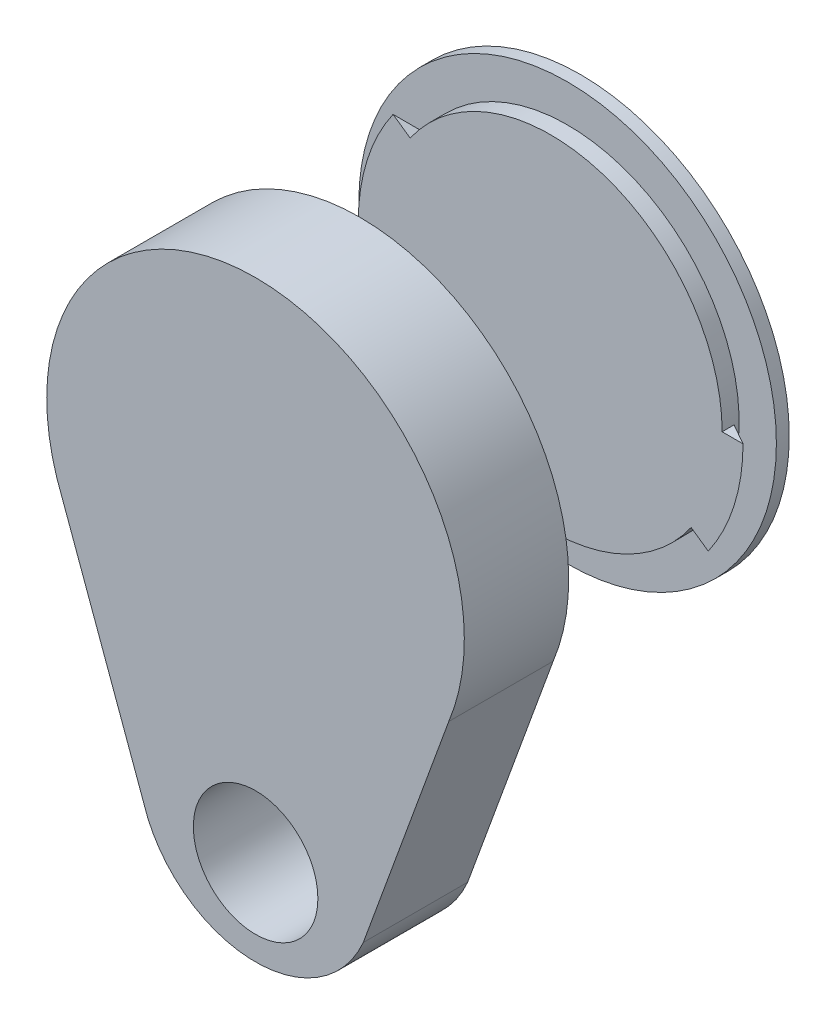
ISO-10303-21;
HEADER;
FILE_DESCRIPTION(('STEP AP214'),'2;1');
FILE_NAME('part.step','',(''),(''),'','','');
FILE_SCHEMA(('AUTOMOTIVE_DESIGN { 1 0 10303 214 1 1 1 1 }'));
ENDSEC;
DATA;
#1=APPLICATION_CONTEXT('core data for automotive mechanical design processes');
#2=APPLICATION_PROTOCOL_DEFINITION('international standard','automotive_design',2000,#1);
#3=PRODUCT_CONTEXT('',#1,'mechanical');
#4=PRODUCT('Part','Part','',(#3));
#5=PRODUCT_RELATED_PRODUCT_CATEGORY('part','',(#4));
#6=PRODUCT_DEFINITION_FORMATION('','',#4);
#7=PRODUCT_DEFINITION_CONTEXT('part definition',#1,'design');
#8=PRODUCT_DEFINITION('design','',#6,#7);
#9=PRODUCT_DEFINITION_SHAPE('','',#8);
#10=(LENGTH_UNIT() NAMED_UNIT(*) SI_UNIT(.MILLI.,.METRE.));
#11=(NAMED_UNIT(*) PLANE_ANGLE_UNIT() SI_UNIT($,.RADIAN.));
#12=(NAMED_UNIT(*) SI_UNIT($,.STERADIAN.) SOLID_ANGLE_UNIT());
#13=UNCERTAINTY_MEASURE_WITH_UNIT(LENGTH_MEASURE(1.E-05),#10,'distance_accuracy_value','');
#14=(GEOMETRIC_REPRESENTATION_CONTEXT(3) GLOBAL_UNCERTAINTY_ASSIGNED_CONTEXT((#13)) GLOBAL_UNIT_ASSIGNED_CONTEXT((#10,
#11,#12)) REPRESENTATION_CONTEXT('',''));
#15=CARTESIAN_POINT('',(0.,0.,0.));
#16=DIRECTION('',(0.,0.,1.));
#17=DIRECTION('',(1.,0.,0.));
#18=AXIS2_PLACEMENT_3D('',#15,#16,#17);
#19=CARTESIAN_POINT('',(0.663591955990757,0.,-19.6420365367826));
#20=DIRECTION('',(0.,0.,-1.));
#21=DIRECTION('',(-1.,0.,0.));
#22=AXIS2_PLACEMENT_3D('',#19,#20,#21);
#23=CYLINDRICAL_SURFACE('',#22,11.5);
#24=CARTESIAN_POINT('',(0.663591955990757,0.,-18.779037110636));
#25=DIRECTION('',(0.,0.,-1.));
#26=DIRECTION('',(-1.,0.,0.));
#27=AXIS2_PLACEMENT_3D('',#24,#25,#26);
#28=CIRCLE('',#27,11.5);
#29=CARTESIAN_POINT('',(-10.8364080440092,0.,-18.779037110636));
#30=VERTEX_POINT('',#29);
#31=EDGE_CURVE('E151',#30,#30,#28,.T.);
#32=ORIENTED_EDGE('',*,*,#31,.F.);
#33=EDGE_LOOP('',(#32));
#34=FACE_BOUND('',#33,.T.);
#35=CARTESIAN_POINT('',(0.663591955990757,0.,-18.4420365367826));
#36=DIRECTION('',(0.,0.,1.));
#37=DIRECTION('',(-1.,0.,0.));
#38=AXIS2_PLACEMENT_3D('',#35,#36,#37);
#39=CIRCLE('',#38,11.5);
#40=CARTESIAN_POINT('',(10.0838404653142,-6.59612901803705,-18.4420365367826));
#41=VERTEX_POINT('',#40);
#42=CARTESIAN_POINT('',(12.1635919559908,0.,-18.4420365367826));
#43=VERTEX_POINT('',#42);
#44=EDGE_CURVE('E62',#41,#43,#39,.T.);
#45=ORIENTED_EDGE('',*,*,#44,.F.);
#46=DIRECTION('',(0.,0.,-1.));
#47=VECTOR('',#46,1.);
#48=CARTESIAN_POINT('',(10.0838404653142,-6.59612901803704,-18.4420365367826));
#49=LINE('',#48,#47);
#50=CARTESIAN_POINT('',(10.0838404653142,-6.59612901803704,-17.6420365367826));
#51=VERTEX_POINT('',#50);
#52=EDGE_CURVE('E115',#51,#41,#49,.T.);
#53=ORIENTED_EDGE('',*,*,#52,.F.);
#54=CARTESIAN_POINT('',(0.663591955990757,0.,-17.6420365367826));
#55=DIRECTION('',(0.,0.,-1.));
#56=DIRECTION('',(-1.,0.,0.));
#57=AXIS2_PLACEMENT_3D('',#54,#55,#56);
#58=CIRCLE('',#57,11.5);
#59=CARTESIAN_POINT('',(-10.8364080440092,0.,-17.6420365367826));
#60=VERTEX_POINT('',#59);
#61=EDGE_CURVE('E55',#51,#60,#58,.T.);
#62=ORIENTED_EDGE('',*,*,#61,.T.);
#63=DIRECTION('',(0.,0.,-1.));
#64=VECTOR('',#63,1.);
#65=CARTESIAN_POINT('',(-10.8364080440092,0.,-18.4420365367826));
#66=LINE('',#65,#64);
#67=CARTESIAN_POINT('',(-10.8364080440092,0.,-18.4420365367826));
#68=VERTEX_POINT('',#67);
#69=EDGE_CURVE('E107',#60,#68,#66,.T.);
#70=ORIENTED_EDGE('',*,*,#69,.T.);
#71=CARTESIAN_POINT('',(0.663591955990757,0.,-18.4420365367826));
#72=DIRECTION('',(0.,0.,1.));
#73=DIRECTION('',(1.,0.,0.));
#74=AXIS2_PLACEMENT_3D('',#71,#72,#73);
#75=CIRCLE('',#74,11.5);
#76=CARTESIAN_POINT('',(-8.75665655333264,6.59612901803704,-18.4420365367826));
#77=VERTEX_POINT('',#76);
#78=EDGE_CURVE('E141',#77,#68,#75,.T.);
#79=ORIENTED_EDGE('',*,*,#78,.F.);
#80=DIRECTION('',(0.,0.,-1.));
#81=VECTOR('',#80,1.);
#82=CARTESIAN_POINT('',(-8.75665655333264,6.59612901803704,-18.4420365367826));
#83=LINE('',#82,#81);
#84=CARTESIAN_POINT('',(-8.75665655333264,6.59612901803704,-17.6420365367826));
#85=VERTEX_POINT('',#84);
#86=EDGE_CURVE('E132',#85,#77,#83,.T.);
#87=ORIENTED_EDGE('',*,*,#86,.F.);
#88=CARTESIAN_POINT('',(12.1635919559908,0.,-17.6420365367826));
#89=VERTEX_POINT('',#88);
#90=EDGE_CURVE('E12',#85,#89,#58,.T.);
#91=ORIENTED_EDGE('',*,*,#90,.T.);
#92=DIRECTION('',(0.,0.,-1.));
#93=VECTOR('',#92,1.);
#94=CARTESIAN_POINT('',(12.1635919559908,0.,-18.4420365367826));
#95=LINE('',#94,#93);
#96=EDGE_CURVE('E66',#89,#43,#95,.T.);
#97=ORIENTED_EDGE('',*,*,#96,.T.);
#98=EDGE_LOOP('',(#45,#53,#62,#70,#79,#87,#91,#97));
#99=FACE_BOUND('',#98,.T.);
#100=ADVANCED_FACE('F47',(#34,#99),#23,.T.);
#101=CARTESIAN_POINT('',(0.663591955990757,0.,-17.6420365367826));
#102=DIRECTION('',(0.,0.,1.));
#103=DIRECTION('',(1.,0.,0.));
#104=AXIS2_PLACEMENT_3D('',#101,#102,#103);
#105=PLANE('',#104);
#106=ORIENTED_EDGE('',*,*,#90,.F.);
#107=DIRECTION('',(0.819152044288991,-0.573576436351047,0.));
#108=VECTOR('',#107,1.);
#109=CARTESIAN_POINT('',(-8.75665655333264,6.59612901803704,-17.6420365367826));
#110=LINE('',#109,#108);
#111=CARTESIAN_POINT('',(-9.90346941533723,7.39913602892851,-17.6420365367826));
#112=VERTEX_POINT('',#111);
#113=EDGE_CURVE('E138',#112,#85,#110,.T.);
#114=ORIENTED_EDGE('',*,*,#113,.F.);
#115=CARTESIAN_POINT('',(0.663591955990757,0.,-17.6420365367826));
#116=DIRECTION('',(0.,0.,1.));
#117=DIRECTION('',(1.,0.,0.));
#118=AXIS2_PLACEMENT_3D('',#115,#116,#117);
#119=CIRCLE('',#118,12.9);
#120=CARTESIAN_POINT('',(-12.2364080440092,0.,-17.6420365367826));
#121=VERTEX_POINT('',#120);
#122=EDGE_CURVE('E144',#112,#121,#119,.T.);
#123=ORIENTED_EDGE('',*,*,#122,.T.);
#124=DIRECTION('',(1.,0.,0.));
#125=VECTOR('',#124,1.);
#126=CARTESIAN_POINT('',(-10.8364080440092,0.,-17.6420365367826));
#127=LINE('',#126,#125);
#128=EDGE_CURVE('E129',#121,#60,#127,.T.);
#129=ORIENTED_EDGE('',*,*,#128,.T.);
#130=ORIENTED_EDGE('',*,*,#61,.F.);
#131=DIRECTION('',(-0.819152044288991,0.573576436351047,0.));
#132=VECTOR('',#131,1.);
#133=CARTESIAN_POINT('',(10.0838404653142,-6.59612901803704,-17.6420365367826));
#134=LINE('',#133,#132);
#135=CARTESIAN_POINT('',(11.2306533273187,-7.39913602892851,-17.6420365367826));
#136=VERTEX_POINT('',#135);
#137=EDGE_CURVE('E104',#136,#51,#134,.T.);
#138=ORIENTED_EDGE('',*,*,#137,.F.);
#139=CARTESIAN_POINT('',(0.663591955990757,0.,-17.6420365367826));
#140=DIRECTION('',(0.,0.,1.));
#141=DIRECTION('',(-1.,0.,0.));
#142=AXIS2_PLACEMENT_3D('',#139,#140,#141);
#143=CIRCLE('',#142,12.9);
#144=CARTESIAN_POINT('',(13.5635919559908,0.,-17.6420365367826));
#145=VERTEX_POINT('',#144);
#146=EDGE_CURVE('E98',#136,#145,#143,.T.);
#147=ORIENTED_EDGE('',*,*,#146,.T.);
#148=DIRECTION('',(-1.,0.,0.));
#149=VECTOR('',#148,1.);
#150=CARTESIAN_POINT('',(12.1635919559908,0.,-17.6420365367826));
#151=LINE('',#150,#149);
#152=EDGE_CURVE('E102',#145,#89,#151,.T.);
#153=ORIENTED_EDGE('',*,*,#152,.T.);
#154=EDGE_LOOP('',(#106,#114,#123,#129,#130,#138,#147,#153));
#155=FACE_BOUND('',#154,.T.);
#156=ADVANCED_FACE('F49',(#155),#105,.T.);
#157=CARTESIAN_POINT('',(-10.8364080440092,0.,-18.779037110636));
#158=DIRECTION('',(0.,0.,1.));
#159=DIRECTION('',(1.,0.,0.));
#160=AXIS2_PLACEMENT_3D('',#157,#158,#159);
#161=PLANE('',#160);
#162=ORIENTED_EDGE('',*,*,#31,.T.);
#163=EDGE_LOOP('',(#162));
#164=FACE_BOUND('',#163,.T.);
#165=CARTESIAN_POINT('',(0.663591955990757,0.,-18.779037110636));
#166=DIRECTION('',(0.,0.,-1.));
#167=DIRECTION('',(-1.,0.,0.));
#168=AXIS2_PLACEMENT_3D('',#165,#166,#167);
#169=CIRCLE('',#168,14.);
#170=CARTESIAN_POINT('',(-13.3364080440092,0.,-18.779037110636));
#171=VERTEX_POINT('',#170);
#172=EDGE_CURVE('E149',#171,#171,#169,.T.);
#173=ORIENTED_EDGE('',*,*,#172,.F.);
#174=EDGE_LOOP('',(#173));
#175=FACE_BOUND('',#174,.T.);
#176=ADVANCED_FACE('F180',(#164,#175),#161,.T.);
#177=CARTESIAN_POINT('',(0.663591955990757,0.,-19.6420365367826));
#178=DIRECTION('',(0.,0.,-1.));
#179=DIRECTION('',(-1.,0.,0.));
#180=AXIS2_PLACEMENT_3D('',#177,#178,#179);
#181=CYLINDRICAL_SURFACE('',#180,14.);
#182=ORIENTED_EDGE('',*,*,#172,.T.);
#183=EDGE_LOOP('',(#182));
#184=FACE_BOUND('',#183,.T.);
#185=CARTESIAN_POINT('',(0.663591955990757,0.,-19.6420365367826));
#186=DIRECTION('',(0.,0.,-1.));
#187=DIRECTION('',(-1.,0.,0.));
#188=AXIS2_PLACEMENT_3D('',#185,#186,#187);
#189=CIRCLE('',#188,14.);
#190=CARTESIAN_POINT('',(-13.3364080440092,0.,-19.6420365367826));
#191=VERTEX_POINT('',#190);
#192=EDGE_CURVE('E146',#191,#191,#189,.T.);
#193=ORIENTED_EDGE('',*,*,#192,.F.);
#194=EDGE_LOOP('',(#193));
#195=FACE_BOUND('',#194,.T.);
#196=ADVANCED_FACE('F184',(#184,#195),#181,.T.);
#197=CARTESIAN_POINT('',(-13.3364080440092,0.,-19.6420365367826));
#198=DIRECTION('',(0.,0.,-1.));
#199=DIRECTION('',(-1.,0.,0.));
#200=AXIS2_PLACEMENT_3D('',#197,#198,#199);
#201=PLANE('',#200);
#202=ORIENTED_EDGE('',*,*,#192,.T.);
#203=EDGE_LOOP('',(#202));
#204=FACE_BOUND('',#203,.T.);
#205=ADVANCED_FACE('F173',(#204),#201,.T.);
#206=CARTESIAN_POINT('',(0.663591955990757,0.,-18.4420365367826));
#207=DIRECTION('',(0.,0.,1.));
#208=DIRECTION('',(1.,0.,0.));
#209=AXIS2_PLACEMENT_3D('',#206,#207,#208);
#210=CONICAL_SURFACE('',#209,11.5,1.05165021254837);
#211=DIRECTION('',(-0.711223144811148,0.498003807345983,0.496138938356833));
#212=VECTOR('',#211,1.);
#213=CARTESIAN_POINT('',(-9.90346941533723,7.39913602892851,-17.6420365367826));
#214=LINE('',#213,#212);
#215=EDGE_CURVE('E135',#77,#112,#214,.T.);
#216=ORIENTED_EDGE('',*,*,#215,.F.);
#217=ORIENTED_EDGE('',*,*,#78,.T.);
#218=DIRECTION('',(-0.86824314212446,0.,0.496138938356833));
#219=VECTOR('',#218,1.);
#220=CARTESIAN_POINT('',(-12.2364080440092,0.,-17.6420365367826));
#221=LINE('',#220,#219);
#222=EDGE_CURVE('E126',#68,#121,#221,.T.);
#223=ORIENTED_EDGE('',*,*,#222,.T.);
#224=ORIENTED_EDGE('',*,*,#122,.F.);
#225=EDGE_LOOP('',(#216,#217,#223,#224));
#226=FACE_BOUND('',#225,.T.);
#227=ADVANCED_FACE('F163',(#226),#210,.T.);
#228=CARTESIAN_POINT('',(0.120009248667199,0.3806207093084,0.));
#229=DIRECTION('',(-0.573576436351047,-0.819152044288991,0.));
#230=DIRECTION('',(0.,0.,-1.));
#231=AXIS2_PLACEMENT_3D('',#228,#229,#230);
#232=PLANE('',#231);
#233=ORIENTED_EDGE('',*,*,#86,.T.);
#234=ORIENTED_EDGE('',*,*,#215,.T.);
#235=ORIENTED_EDGE('',*,*,#113,.T.);
#236=EDGE_LOOP('',(#233,#234,#235));
#237=FACE_BOUND('',#236,.T.);
#238=ADVANCED_FACE('F165',(#237),#232,.F.);
#239=CARTESIAN_POINT('',(0.,0.,0.));
#240=DIRECTION('',(0.,-1.,0.));
#241=DIRECTION('',(0.,0.,-1.));
#242=AXIS2_PLACEMENT_3D('',#239,#240,#241);
#243=PLANE('',#242);
#244=ORIENTED_EDGE('',*,*,#69,.F.);
#245=ORIENTED_EDGE('',*,*,#128,.F.);
#246=ORIENTED_EDGE('',*,*,#222,.F.);
#247=EDGE_LOOP('',(#244,#245,#246));
#248=FACE_BOUND('',#247,.T.);
#249=ADVANCED_FACE('F160',(#248),#243,.T.);
#250=CARTESIAN_POINT('',(0.663591955990757,0.,-18.4420365367826));
#251=DIRECTION('',(0.,0.,1.));
#252=DIRECTION('',(-1.,0.,0.));
#253=AXIS2_PLACEMENT_3D('',#250,#251,#252);
#254=CONICAL_SURFACE('',#253,11.5,1.05165021254837);
#255=DIRECTION('',(0.711223144811148,-0.498003807345983,0.496138938356833));
#256=VECTOR('',#255,1.);
#257=CARTESIAN_POINT('',(11.2306533273187,-7.39913602892851,-17.6420365367826));
#258=LINE('',#257,#256);
#259=EDGE_CURVE('E118',#41,#136,#258,.T.);
#260=ORIENTED_EDGE('',*,*,#259,.F.);
#261=ORIENTED_EDGE('',*,*,#44,.T.);
#262=DIRECTION('',(0.86824314212446,0.,0.496138938356833));
#263=VECTOR('',#262,1.);
#264=CARTESIAN_POINT('',(13.5635919559908,0.,-17.6420365367826));
#265=LINE('',#264,#263);
#266=EDGE_CURVE('E110',#43,#145,#265,.T.);
#267=ORIENTED_EDGE('',*,*,#266,.T.);
#268=ORIENTED_EDGE('',*,*,#146,.F.);
#269=EDGE_LOOP('',(#260,#261,#267,#268));
#270=FACE_BOUND('',#269,.T.);
#271=ADVANCED_FACE('F111',(#270),#254,.T.);
#272=CARTESIAN_POINT('',(1.20717466331432,-0.3806207093084,0.));
#273=DIRECTION('',(0.573576436351047,0.819152044288991,0.));
#274=DIRECTION('',(0.,0.,-1.));
#275=AXIS2_PLACEMENT_3D('',#272,#273,#274);
#276=PLANE('',#275);
#277=ORIENTED_EDGE('',*,*,#52,.T.);
#278=ORIENTED_EDGE('',*,*,#259,.T.);
#279=ORIENTED_EDGE('',*,*,#137,.T.);
#280=EDGE_LOOP('',(#277,#278,#279));
#281=FACE_BOUND('',#280,.T.);
#282=ADVANCED_FACE('F231',(#281),#276,.F.);
#283=CARTESIAN_POINT('',(1.32718391198152,0.,0.));
#284=DIRECTION('',(0.,1.,0.));
#285=DIRECTION('',(0.,0.,-1.));
#286=AXIS2_PLACEMENT_3D('',#283,#284,#285);
#287=PLANE('',#286);
#288=ORIENTED_EDGE('',*,*,#96,.F.);
#289=ORIENTED_EDGE('',*,*,#152,.F.);
#290=ORIENTED_EDGE('',*,*,#266,.F.);
#291=EDGE_LOOP('',(#288,#289,#290));
#292=FACE_BOUND('',#291,.T.);
#293=ADVANCED_FACE('F114',(#292),#287,.T.);
#294=CLOSED_SHELL('',(#100,#156,#176,#196,#205,#227,#238,#249,#271,#282,#293));
#295=MANIFOLD_SOLID_BREP('B2',#294);
#296=CARTESIAN_POINT('',(1.56253248721312,0.,2.04604094610826));
#297=DIRECTION('',(0.,0.,-1.));
#298=DIRECTION('',(-1.,0.,0.));
#299=AXIS2_PLACEMENT_3D('',#296,#297,#298);
#300=CYLINDRICAL_SURFACE('',#299,13.);
#301=CARTESIAN_POINT('',(1.56253248721312,0.,2.04604094610826));
#302=DIRECTION('',(0.,0.,-1.));
#303=DIRECTION('',(-1.,0.,0.));
#304=AXIS2_PLACEMENT_3D('',#301,#302,#303);
#305=CIRCLE('',#304,13.);
#306=CARTESIAN_POINT('',(-11.4374675127869,0.,2.04604094610826));
#307=VERTEX_POINT('',#306);
#308=EDGE_CURVE('E433',#307,#307,#305,.T.);
#309=ORIENTED_EDGE('',*,*,#308,.F.);
#310=EDGE_LOOP('',(#309));
#311=FACE_BOUND('',#310,.T.);
#312=CARTESIAN_POINT('',(1.56253248721312,0.,-3.15395905389174));
#313=DIRECTION('',(0.,0.,1.));
#314=DIRECTION('',(-1.,0.,0.));
#315=AXIS2_PLACEMENT_3D('',#312,#313,#314);
#316=CIRCLE('',#315,13.);
#317=CARTESIAN_POINT('',(-8.39604527333364,-8.35623892592496,-3.15395905389174));
#318=VERTEX_POINT('',#317);
#319=CARTESIAN_POINT('',(14.5625324872131,0.,-3.15395905389174));
#320=VERTEX_POINT('',#319);
#321=EDGE_CURVE('E291',#318,#320,#316,.T.);
#322=ORIENTED_EDGE('',*,*,#321,.F.);
#323=DIRECTION('',(0.,0.,1.));
#324=VECTOR('',#323,1.);
#325=CARTESIAN_POINT('',(-8.39604527333364,-8.35623892592496,-3.15395905389174));
#326=LINE('',#325,#324);
#327=CARTESIAN_POINT('',(-8.39604527333364,-8.35623892592496,-3.95395905389174));
#328=VERTEX_POINT('',#327);
#329=EDGE_CURVE('E369',#328,#318,#326,.T.);
#330=ORIENTED_EDGE('',*,*,#329,.F.);
#331=CARTESIAN_POINT('',(1.56253248721312,0.,-3.95395905389174));
#332=DIRECTION('',(0.,0.,-1.));
#333=DIRECTION('',(-1.,0.,0.));
#334=AXIS2_PLACEMENT_3D('',#331,#332,#333);
#335=CIRCLE('',#334,13.);
#336=CARTESIAN_POINT('',(-11.4374675127869,0.,-3.95395905389174));
#337=VERTEX_POINT('',#336);
#338=EDGE_CURVE('E436',#328,#337,#335,.T.);
#339=ORIENTED_EDGE('',*,*,#338,.T.);
#340=DIRECTION('',(0.,0.,1.));
#341=VECTOR('',#340,1.);
#342=CARTESIAN_POINT('',(-11.4374675127869,0.,-3.15395905389174));
#343=LINE('',#342,#341);
#344=CARTESIAN_POINT('',(-11.4374675127869,0.,-3.15395905389174));
#345=VERTEX_POINT('',#344);
#346=EDGE_CURVE('E361',#337,#345,#343,.T.);
#347=ORIENTED_EDGE('',*,*,#346,.T.);
#348=CARTESIAN_POINT('',(1.56253248721312,0.,-3.15395905389174));
#349=DIRECTION('',(0.,0.,1.));
#350=DIRECTION('',(1.,0.,0.));
#351=AXIS2_PLACEMENT_3D('',#348,#349,#350);
#352=CIRCLE('',#351,13.);
#353=CARTESIAN_POINT('',(11.5211102477599,8.35623892592496,-3.15395905389174));
#354=VERTEX_POINT('',#353);
#355=EDGE_CURVE('E395',#354,#345,#352,.T.);
#356=ORIENTED_EDGE('',*,*,#355,.F.);
#357=DIRECTION('',(0.,0.,1.));
#358=VECTOR('',#357,1.);
#359=CARTESIAN_POINT('',(11.5211102477599,8.35623892592496,-3.15395905389174));
#360=LINE('',#359,#358);
#361=CARTESIAN_POINT('',(11.5211102477599,8.35623892592495,-3.95395905389174));
#362=VERTEX_POINT('',#361);
#363=EDGE_CURVE('E386',#362,#354,#360,.T.);
#364=ORIENTED_EDGE('',*,*,#363,.F.);
#365=CARTESIAN_POINT('',(14.5625324872131,0.,-3.95395905389174));
#366=VERTEX_POINT('',#365);
#367=EDGE_CURVE('E437',#362,#366,#335,.T.);
#368=ORIENTED_EDGE('',*,*,#367,.T.);
#369=DIRECTION('',(0.,0.,1.));
#370=VECTOR('',#369,1.);
#371=CARTESIAN_POINT('',(14.5625324872131,0.,-3.15395905389174));
#372=LINE('',#371,#370);
#373=EDGE_CURVE('E296',#366,#320,#372,.T.);
#374=ORIENTED_EDGE('',*,*,#373,.T.);
#375=EDGE_LOOP('',(#322,#330,#339,#347,#356,#364,#368,#374));
#376=FACE_BOUND('',#375,.T.);
#377=ADVANCED_FACE('F276',(#311,#376),#300,.F.);
#378=CARTESIAN_POINT('',(1.56253248721312,0.,3.04604094610826));
#379=DIRECTION('',(0.,0.,1.));
#380=DIRECTION('',(1.,0.,0.));
#381=AXIS2_PLACEMENT_3D('',#378,#379,#380);
#382=PLANE('',#381);
#383=CARTESIAN_POINT('',(1.56883584325146,-19.9707842026667,3.04604094610826));
#384=DIRECTION('',(0.,0.,1.));
#385=DIRECTION('',(1.,0.,0.));
#386=AXIS2_PLACEMENT_3D('',#383,#384,#385);
#387=CIRCLE('',#386,4.17530587226947);
#388=CARTESIAN_POINT('',(5.74414171552093,-19.9707842026667,3.04604094610826));
#389=VERTEX_POINT('',#388);
#390=EDGE_CURVE('E400',#389,#389,#387,.T.);
#391=ORIENTED_EDGE('',*,*,#390,.F.);
#392=EDGE_LOOP('',(#391));
#393=FACE_BOUND('',#392,.T.);
#394=CARTESIAN_POINT('',(1.56253248721312,0.,3.04604094610826));
#395=DIRECTION('',(0.,0.,-1.));
#396=DIRECTION('',(-1.,0.,0.));
#397=AXIS2_PLACEMENT_3D('',#394,#395,#396);
#398=CIRCLE('',#397,14.);
#399=CARTESIAN_POINT('',(-11.3937503946181,-5.30421849907854,3.04604094610826));
#400=VERTEX_POINT('',#399);
#401=CARTESIAN_POINT('',(14.5188153690457,-5.30421849907517,3.04604094610826));
#402=VERTEX_POINT('',#401);
#403=EDGE_CURVE('E45',#400,#402,#398,.T.);
#404=ORIENTED_EDGE('',*,*,#403,.F.);
#405=DIRECTION('',(0.342928016815301,-0.93936168501974,0.));
#406=VECTOR('',#405,1.);
#407=CARTESIAN_POINT('',(-5.66377086882536,-21.,3.04604094610826));
#408=LINE('',#407,#406);
#409=CARTESIAN_POINT('',(-5.66377086882536,-21.,3.04604094610826));
#410=VERTEX_POINT('',#409);
#411=EDGE_CURVE('E404',#400,#410,#408,.T.);
#412=ORIENTED_EDGE('',*,*,#411,.T.);
#413=CARTESIAN_POINT('',(1.56253248721305,-17.8753087844882,3.04604094610826));
#414=DIRECTION('',(0.,0.,1.));
#415=DIRECTION('',(-1.,0.,0.));
#416=AXIS2_PLACEMENT_3D('',#413,#414,#415);
#417=CIRCLE('',#416,7.87293816727836);
#418=CARTESIAN_POINT('',(8.78883584325146,-21.,3.04604094610826));
#419=VERTEX_POINT('',#418);
#420=EDGE_CURVE('E418',#410,#419,#417,.T.);
#421=ORIENTED_EDGE('',*,*,#420,.T.);
#422=DIRECTION('',(0.342928016815316,0.939361685019734,0.));
#423=VECTOR('',#422,1.);
#424=CARTESIAN_POINT('',(14.8888396600129,-4.29063365205939,3.04604094610826));
#425=LINE('',#424,#423);
#426=EDGE_CURVE('E410',#419,#402,#425,.T.);
#427=ORIENTED_EDGE('',*,*,#426,.T.);
#428=EDGE_LOOP('',(#404,#412,#421,#427));
#429=FACE_BOUND('',#428,.T.);
#430=ADVANCED_FACE('F278',(#393,#429),#382,.T.);
#431=CARTESIAN_POINT('',(1.56253248721312,0.,2.04604094610826));
#432=DIRECTION('',(0.,0.,-1.));
#433=DIRECTION('',(-1.,0.,0.));
#434=AXIS2_PLACEMENT_3D('',#431,#432,#433);
#435=CYLINDRICAL_SURFACE('',#434,14.);
#436=DIRECTION('',(0.,0.,-1.));
#437=VECTOR('',#436,1.);
#438=CARTESIAN_POINT('',(-11.3937503946181,-5.30421849907855,2.04604094610826));
#439=LINE('',#438,#437);
#440=CARTESIAN_POINT('',(-11.3937503946181,-5.30421849907855,-3.95395905389174));
#441=VERTEX_POINT('',#440);
#442=EDGE_CURVE('E425',#400,#441,#439,.T.);
#443=ORIENTED_EDGE('',*,*,#442,.F.);
#444=ORIENTED_EDGE('',*,*,#403,.T.);
#445=DIRECTION('',(0.,0.,-1.));
#446=VECTOR('',#445,1.);
#447=CARTESIAN_POINT('',(14.5188153690457,-5.30421849907514,2.04604094610826));
#448=LINE('',#447,#446);
#449=CARTESIAN_POINT('',(14.5188153690457,-5.30421849907517,-3.95395905389174));
#450=VERTEX_POINT('',#449);
#451=EDGE_CURVE('E430',#450,#402,#448,.F.);
#452=ORIENTED_EDGE('',*,*,#451,.F.);
#453=CARTESIAN_POINT('',(1.56253248721312,0.,-3.95395905389174));
#454=DIRECTION('',(0.,0.,-1.));
#455=DIRECTION('',(-1.,0.,0.));
#456=AXIS2_PLACEMENT_3D('',#453,#454,#455);
#457=CIRCLE('',#456,14.);
#458=EDGE_CURVE('E284',#441,#450,#457,.T.);
#459=ORIENTED_EDGE('',*,*,#458,.F.);
#460=EDGE_LOOP('',(#443,#444,#452,#459));
#461=FACE_BOUND('',#460,.T.);
#462=ADVANCED_FACE('F455',(#461),#435,.T.);
#463=CARTESIAN_POINT('',(-12.4374675127869,0.,-3.95395905389174));
#464=DIRECTION('',(0.,0.,-1.));
#465=DIRECTION('',(-1.,0.,0.));
#466=AXIS2_PLACEMENT_3D('',#463,#464,#465);
#467=PLANE('',#466);
#468=CARTESIAN_POINT('',(1.56883584325146,-19.9707842026667,-3.95395905389174));
#469=DIRECTION('',(0.,0.,1.));
#470=DIRECTION('',(1.,0.,0.));
#471=AXIS2_PLACEMENT_3D('',#468,#469,#470);
#472=CIRCLE('',#471,4.17530587226947);
#473=CARTESIAN_POINT('',(5.74414171552093,-19.9707842026667,-3.95395905389174));
#474=VERTEX_POINT('',#473);
#475=EDGE_CURVE('E401',#474,#474,#472,.T.);
#476=ORIENTED_EDGE('',*,*,#475,.T.);
#477=EDGE_LOOP('',(#476));
#478=FACE_BOUND('',#477,.T.);
#479=DIRECTION('',(0.342928016815301,-0.93936168501974,0.));
#480=VECTOR('',#479,1.);
#481=CARTESIAN_POINT('',(-5.66377086882536,-21.,-3.95395905389174));
#482=LINE('',#481,#480);
#483=CARTESIAN_POINT('',(-5.66377086882536,-21.,-3.95395905389174));
#484=VERTEX_POINT('',#483);
#485=EDGE_CURVE('E407',#441,#484,#482,.T.);
#486=ORIENTED_EDGE('',*,*,#485,.F.);
#487=ORIENTED_EDGE('',*,*,#458,.T.);
#488=DIRECTION('',(0.342928016815316,0.939361685019734,0.));
#489=VECTOR('',#488,1.);
#490=CARTESIAN_POINT('',(14.8888396600129,-4.29063365205939,-3.95395905389174));
#491=LINE('',#490,#489);
#492=CARTESIAN_POINT('',(8.78883584325146,-21.,-3.95395905389174));
#493=VERTEX_POINT('',#492);
#494=EDGE_CURVE('E413',#493,#450,#491,.T.);
#495=ORIENTED_EDGE('',*,*,#494,.F.);
#496=CARTESIAN_POINT('',(1.56253248721305,-17.8753087844882,-3.95395905389174));
#497=DIRECTION('',(0.,0.,1.));
#498=DIRECTION('',(-1.,0.,0.));
#499=AXIS2_PLACEMENT_3D('',#496,#497,#498);
#500=CIRCLE('',#499,7.87293816727836);
#501=EDGE_CURVE('E409',#484,#493,#500,.T.);
#502=ORIENTED_EDGE('',*,*,#501,.F.);
#503=EDGE_LOOP('',(#486,#487,#495,#502));
#504=FACE_BOUND('',#503,.T.);
#505=ORIENTED_EDGE('',*,*,#367,.F.);
#506=DIRECTION('',(0.766044443118982,0.642787609686535,0.));
#507=VECTOR('',#506,1.);
#508=CARTESIAN_POINT('',(11.5211102477599,8.35623892592496,-3.95395905389174));
#509=LINE('',#508,#507);
#510=CARTESIAN_POINT('',(10.3720435830814,7.39205751139515,-3.95395905389174));
#511=VERTEX_POINT('',#510);
#512=EDGE_CURVE('E392',#511,#362,#509,.T.);
#513=ORIENTED_EDGE('',*,*,#512,.F.);
#514=CARTESIAN_POINT('',(1.56253248721312,0.,-3.95395905389174));
#515=DIRECTION('',(0.,0.,1.));
#516=DIRECTION('',(1.,0.,0.));
#517=AXIS2_PLACEMENT_3D('',#514,#515,#516);
#518=CIRCLE('',#517,11.5);
#519=CARTESIAN_POINT('',(-9.93746751278688,0.,-3.95395905389174));
#520=VERTEX_POINT('',#519);
#521=EDGE_CURVE('E398',#511,#520,#518,.T.);
#522=ORIENTED_EDGE('',*,*,#521,.T.);
#523=DIRECTION('',(-1.,0.,0.));
#524=VECTOR('',#523,1.);
#525=CARTESIAN_POINT('',(-11.4374675127869,0.,-3.95395905389174));
#526=LINE('',#525,#524);
#527=EDGE_CURVE('E383',#520,#337,#526,.T.);
#528=ORIENTED_EDGE('',*,*,#527,.T.);
#529=ORIENTED_EDGE('',*,*,#338,.F.);
#530=DIRECTION('',(-0.766044443118982,-0.642787609686535,0.));
#531=VECTOR('',#530,1.);
#532=CARTESIAN_POINT('',(-8.39604527333364,-8.35623892592496,-3.95395905389174));
#533=LINE('',#532,#531);
#534=CARTESIAN_POINT('',(-7.24697860865517,-7.39205751139515,-3.95395905389174));
#535=VERTEX_POINT('',#534);
#536=EDGE_CURVE('E358',#535,#328,#533,.T.);
#537=ORIENTED_EDGE('',*,*,#536,.F.);
#538=CARTESIAN_POINT('',(1.56253248721312,0.,-3.95395905389174));
#539=DIRECTION('',(0.,0.,1.));
#540=DIRECTION('',(-1.,0.,0.));
#541=AXIS2_PLACEMENT_3D('',#538,#539,#540);
#542=CIRCLE('',#541,11.5);
#543=CARTESIAN_POINT('',(13.0625324872131,0.,-3.95395905389174));
#544=VERTEX_POINT('',#543);
#545=EDGE_CURVE('E351',#535,#544,#542,.T.);
#546=ORIENTED_EDGE('',*,*,#545,.T.);
#547=DIRECTION('',(1.,0.,0.));
#548=VECTOR('',#547,1.);
#549=CARTESIAN_POINT('',(14.5625324872131,0.,-3.95395905389174));
#550=LINE('',#549,#548);
#551=EDGE_CURVE('E356',#544,#366,#550,.T.);
#552=ORIENTED_EDGE('',*,*,#551,.T.);
#553=EDGE_LOOP('',(#505,#513,#522,#528,#529,#537,#546,#552));
#554=FACE_BOUND('',#553,.T.);
#555=ADVANCED_FACE('F354',(#478,#504,#554),#467,.T.);
#556=CARTESIAN_POINT('',(-11.4374675127869,0.,2.04604094610826));
#557=DIRECTION('',(0.,0.,-1.));
#558=DIRECTION('',(-1.,0.,0.));
#559=AXIS2_PLACEMENT_3D('',#556,#557,#558);
#560=PLANE('',#559);
#561=ORIENTED_EDGE('',*,*,#308,.T.);
#562=EDGE_LOOP('',(#561));
#563=FACE_BOUND('',#562,.T.);
#564=ADVANCED_FACE('F485',(#563),#560,.T.);
#565=CARTESIAN_POINT('',(14.8888396600129,-4.29063365205939,-3.95395905389174));
#566=DIRECTION('',(0.939361685019734,-0.342928016815316,0.));
#567=DIRECTION('',(0.342928016815316,0.939361685019734,0.));
#568=AXIS2_PLACEMENT_3D('',#565,#566,#567);
#569=PLANE('',#568);
#570=ORIENTED_EDGE('',*,*,#494,.T.);
#571=ORIENTED_EDGE('',*,*,#451,.T.);
#572=ORIENTED_EDGE('',*,*,#426,.F.);
#573=DIRECTION('',(0.,0.,1.));
#574=VECTOR('',#573,1.);
#575=CARTESIAN_POINT('',(8.78883584325146,-21.,-3.95395905389174));
#576=LINE('',#575,#574);
#577=EDGE_CURVE('E423',#493,#419,#576,.T.);
#578=ORIENTED_EDGE('',*,*,#577,.F.);
#579=EDGE_LOOP('',(#570,#571,#572,#578));
#580=FACE_BOUND('',#579,.T.);
#581=ADVANCED_FACE('F446',(#580),#569,.T.);
#582=CARTESIAN_POINT('',(1.56253248721305,-17.8753087844882,-3.95395905389174));
#583=DIRECTION('',(0.,0.,1.));
#584=DIRECTION('',(1.,0.,0.));
#585=AXIS2_PLACEMENT_3D('',#582,#583,#584);
#586=CYLINDRICAL_SURFACE('',#585,7.87293816727836);
#587=ORIENTED_EDGE('',*,*,#420,.F.);
#588=DIRECTION('',(0.,0.,1.));
#589=VECTOR('',#588,1.);
#590=CARTESIAN_POINT('',(-5.66377086882536,-21.,-3.95395905389174));
#591=LINE('',#590,#589);
#592=EDGE_CURVE('E416',#484,#410,#591,.T.);
#593=ORIENTED_EDGE('',*,*,#592,.F.);
#594=ORIENTED_EDGE('',*,*,#501,.T.);
#595=ORIENTED_EDGE('',*,*,#577,.T.);
#596=EDGE_LOOP('',(#587,#593,#594,#595));
#597=FACE_BOUND('',#596,.T.);
#598=ADVANCED_FACE('F451',(#597),#586,.T.);
#599=CARTESIAN_POINT('',(-5.66377086882536,-21.,-3.95395905389174));
#600=DIRECTION('',(-0.93936168501974,-0.342928016815301,0.));
#601=DIRECTION('',(0.342928016815301,-0.93936168501974,0.));
#602=AXIS2_PLACEMENT_3D('',#599,#600,#601);
#603=PLANE('',#602);
#604=ORIENTED_EDGE('',*,*,#411,.F.);
#605=ORIENTED_EDGE('',*,*,#442,.T.);
#606=ORIENTED_EDGE('',*,*,#485,.T.);
#607=ORIENTED_EDGE('',*,*,#592,.T.);
#608=EDGE_LOOP('',(#604,#605,#606,#607));
#609=FACE_BOUND('',#608,.T.);
#610=ADVANCED_FACE('F454',(#609),#603,.T.);
#611=CARTESIAN_POINT('',(1.56883584325146,-19.9707842026667,-3.95395905389174));
#612=DIRECTION('',(0.,0.,1.));
#613=DIRECTION('',(1.,0.,0.));
#614=AXIS2_PLACEMENT_3D('',#611,#612,#613);
#615=CYLINDRICAL_SURFACE('',#614,4.17530587226947);
#616=ORIENTED_EDGE('',*,*,#475,.F.);
#617=EDGE_LOOP('',(#616));
#618=FACE_BOUND('',#617,.T.);
#619=ORIENTED_EDGE('',*,*,#390,.T.);
#620=EDGE_LOOP('',(#619));
#621=FACE_BOUND('',#620,.T.);
#622=ADVANCED_FACE('F467',(#618,#621),#615,.F.);
#623=CARTESIAN_POINT('',(1.56253248721312,0.,-3.15395905389174));
#624=DIRECTION('',(0.,0.,1.));
#625=DIRECTION('',(1.,0.,0.));
#626=AXIS2_PLACEMENT_3D('',#623,#624,#625);
#627=CONICAL_SURFACE('',#626,13.,1.08083900054117);
#628=DIRECTION('',(-0.675921567457925,-0.567165537958707,-0.470588235294118));
#629=VECTOR('',#628,1.);
#630=CARTESIAN_POINT('',(10.3720435830814,7.39205751139515,-3.95395905389174));
#631=LINE('',#630,#629);
#632=EDGE_CURVE('E389',#354,#511,#631,.T.);
#633=ORIENTED_EDGE('',*,*,#632,.F.);
#634=ORIENTED_EDGE('',*,*,#355,.T.);
#635=DIRECTION('',(0.882352941176471,0.,-0.470588235294118));
#636=VECTOR('',#635,1.);
#637=CARTESIAN_POINT('',(-9.93746751278688,0.,-3.95395905389174));
#638=LINE('',#637,#636);
#639=EDGE_CURVE('E380',#345,#520,#638,.T.);
#640=ORIENTED_EDGE('',*,*,#639,.T.);
#641=ORIENTED_EDGE('',*,*,#521,.F.);
#642=EDGE_LOOP('',(#633,#634,#640,#641));
#643=FACE_BOUND('',#642,.T.);
#644=ADVANCED_FACE('F469',(#643),#627,.F.);
#645=CARTESIAN_POINT('',(2.75950181623561,1.00437652251328,0.));
#646=DIRECTION('',(-0.642787609686535,0.766044443118982,0.));
#647=DIRECTION('',(0.,0.,-1.));
#648=AXIS2_PLACEMENT_3D('',#645,#646,#647);
#649=PLANE('',#648);
#650=ORIENTED_EDGE('',*,*,#363,.T.);
#651=ORIENTED_EDGE('',*,*,#632,.T.);
#652=ORIENTED_EDGE('',*,*,#512,.T.);
#653=EDGE_LOOP('',(#650,#651,#652));
#654=FACE_BOUND('',#653,.T.);
#655=ADVANCED_FACE('F476',(#654),#649,.F.);
#656=CARTESIAN_POINT('',(0.,0.,0.));
#657=DIRECTION('',(0.,-1.,0.));
#658=DIRECTION('',(0.,0.,-1.));
#659=AXIS2_PLACEMENT_3D('',#656,#657,#658);
#660=PLANE('',#659);
#661=ORIENTED_EDGE('',*,*,#346,.F.);
#662=ORIENTED_EDGE('',*,*,#527,.F.);
#663=ORIENTED_EDGE('',*,*,#639,.F.);
#664=EDGE_LOOP('',(#661,#662,#663));
#665=FACE_BOUND('',#664,.T.);
#666=ADVANCED_FACE('F541',(#665),#660,.T.);
#667=CARTESIAN_POINT('',(1.56253248721312,0.,-3.15395905389174));
#668=DIRECTION('',(0.,0.,1.));
#669=DIRECTION('',(-1.,0.,0.));
#670=AXIS2_PLACEMENT_3D('',#667,#668,#669);
#671=CONICAL_SURFACE('',#670,13.,1.08083900054117);
#672=DIRECTION('',(0.675921567457925,0.567165537958707,-0.470588235294118));
#673=VECTOR('',#672,1.);
#674=CARTESIAN_POINT('',(-7.24697860865517,-7.39205751139515,-3.95395905389174));
#675=LINE('',#674,#673);
#676=EDGE_CURVE('E372',#318,#535,#675,.T.);
#677=ORIENTED_EDGE('',*,*,#676,.F.);
#678=ORIENTED_EDGE('',*,*,#321,.T.);
#679=DIRECTION('',(-0.882352941176471,0.,-0.470588235294118));
#680=VECTOR('',#679,1.);
#681=CARTESIAN_POINT('',(13.0625324872131,0.,-3.95395905389174));
#682=LINE('',#681,#680);
#683=EDGE_CURVE('E364',#320,#544,#682,.T.);
#684=ORIENTED_EDGE('',*,*,#683,.T.);
#685=ORIENTED_EDGE('',*,*,#545,.F.);
#686=EDGE_LOOP('',(#677,#678,#684,#685));
#687=FACE_BOUND('',#686,.T.);
#688=ADVANCED_FACE('F365',(#687),#671,.F.);
#689=CARTESIAN_POINT('',(0.365563158190627,-1.00437652251328,0.));
#690=DIRECTION('',(0.642787609686535,-0.766044443118982,0.));
#691=DIRECTION('',(0.,0.,-1.));
#692=AXIS2_PLACEMENT_3D('',#689,#690,#691);
#693=PLANE('',#692);
#694=ORIENTED_EDGE('',*,*,#329,.T.);
#695=ORIENTED_EDGE('',*,*,#676,.T.);
#696=ORIENTED_EDGE('',*,*,#536,.T.);
#697=EDGE_LOOP('',(#694,#695,#696));
#698=FACE_BOUND('',#697,.T.);
#699=ADVANCED_FACE('F572',(#698),#693,.F.);
#700=CARTESIAN_POINT('',(3.12506497442623,0.,0.));
#701=DIRECTION('',(0.,1.,0.));
#702=DIRECTION('',(0.,0.,-1.));
#703=AXIS2_PLACEMENT_3D('',#700,#701,#702);
#704=PLANE('',#703);
#705=ORIENTED_EDGE('',*,*,#373,.F.);
#706=ORIENTED_EDGE('',*,*,#551,.F.);
#707=ORIENTED_EDGE('',*,*,#683,.F.);
#708=EDGE_LOOP('',(#705,#706,#707));
#709=FACE_BOUND('',#708,.T.);
#710=ADVANCED_FACE('F368',(#709),#704,.T.);
#711=CLOSED_SHELL('',(#377,#430,#462,#555,#564,#581,#598,#610,#622,#644,#655,#666,#688,#699,#710));
#712=MANIFOLD_SOLID_BREP('B6',#711);
#713=ADVANCED_BREP_SHAPE_REPRESENTATION('',(#18,#295,#712),#14);
#714=SHAPE_DEFINITION_REPRESENTATION(#9,#713);
ENDSEC;
END-ISO-10303-21;
